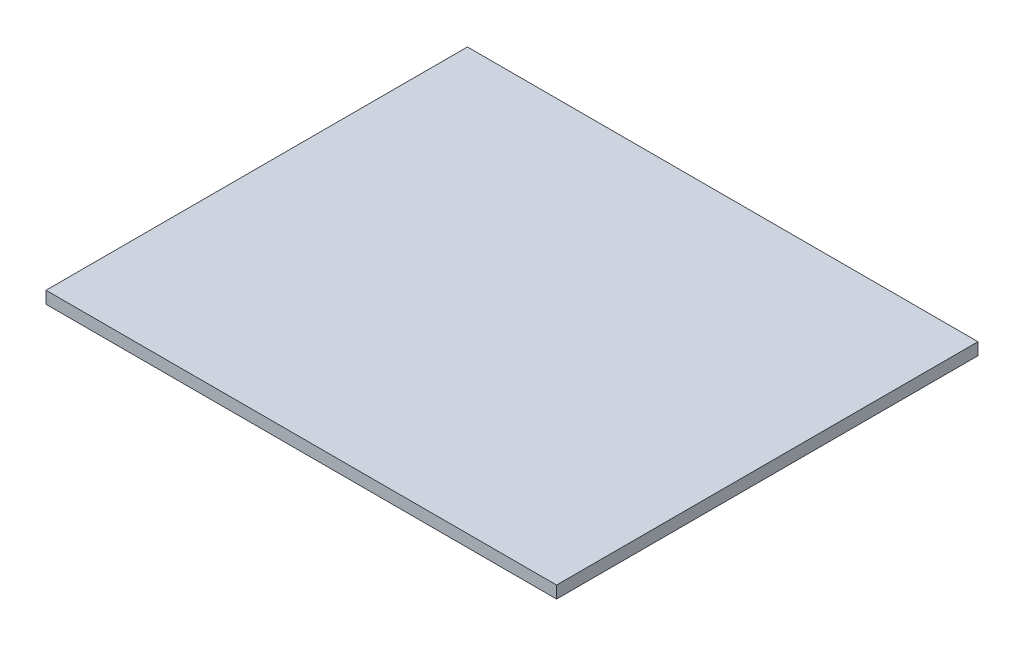
ISO-10303-21;
HEADER;
FILE_DESCRIPTION(('STEP AP214'),'2;1');
FILE_NAME('part.step','',(''),(''),'','','');
FILE_SCHEMA(('AUTOMOTIVE_DESIGN { 1 0 10303 214 1 1 1 1 }'));
ENDSEC;
DATA;
#1=APPLICATION_CONTEXT('core data for automotive mechanical design processes');
#2=APPLICATION_PROTOCOL_DEFINITION('international standard','automotive_design',2000,#1);
#3=PRODUCT_CONTEXT('',#1,'mechanical');
#4=PRODUCT('Part','Part','',(#3));
#5=PRODUCT_RELATED_PRODUCT_CATEGORY('part','',(#4));
#6=PRODUCT_DEFINITION_FORMATION('','',#4);
#7=PRODUCT_DEFINITION_CONTEXT('part definition',#1,'design');
#8=PRODUCT_DEFINITION('design','',#6,#7);
#9=PRODUCT_DEFINITION_SHAPE('','',#8);
#10=(LENGTH_UNIT() NAMED_UNIT(*) SI_UNIT(.MILLI.,.METRE.));
#11=(NAMED_UNIT(*) PLANE_ANGLE_UNIT() SI_UNIT($,.RADIAN.));
#12=(NAMED_UNIT(*) SI_UNIT($,.STERADIAN.) SOLID_ANGLE_UNIT());
#13=UNCERTAINTY_MEASURE_WITH_UNIT(LENGTH_MEASURE(1.E-05),#10,'distance_accuracy_value','');
#14=(GEOMETRIC_REPRESENTATION_CONTEXT(3) GLOBAL_UNCERTAINTY_ASSIGNED_CONTEXT((#13)) GLOBAL_UNIT_ASSIGNED_CONTEXT((#10,
#11,#12)) REPRESENTATION_CONTEXT('',''));
#15=CARTESIAN_POINT('',(0.,0.,0.));
#16=DIRECTION('',(0.,0.,1.));
#17=DIRECTION('',(1.,0.,0.));
#18=AXIS2_PLACEMENT_3D('',#15,#16,#17);
#19=CARTESIAN_POINT('',(0.,4.7625,0.));
#20=DIRECTION('',(1.,0.,0.));
#21=DIRECTION('',(0.,0.,-1.));
#22=AXIS2_PLACEMENT_3D('',#19,#20,#21);
#23=PLANE('',#22);
#24=DIRECTION('',(0.,0.,1.));
#25=VECTOR('',#24,1.);
#26=CARTESIAN_POINT('',(0.,0.,0.));
#27=LINE('',#26,#25);
#28=CARTESIAN_POINT('',(0.,0.,0.));
#29=VERTEX_POINT('',#28);
#30=CARTESIAN_POINT('',(0.,0.,165.1));
#31=VERTEX_POINT('',#30);
#32=EDGE_CURVE('E96',#29,#31,#27,.T.);
#33=ORIENTED_EDGE('',*,*,#32,.T.);
#34=DIRECTION('',(0.,-1.,0.));
#35=VECTOR('',#34,1.);
#36=CARTESIAN_POINT('',(0.,4.7625,165.1));
#37=LINE('',#36,#35);
#38=CARTESIAN_POINT('',(0.,4.7625,165.1));
#39=VERTEX_POINT('',#38);
#40=EDGE_CURVE('E11',#39,#31,#37,.T.);
#41=ORIENTED_EDGE('',*,*,#40,.F.);
#42=DIRECTION('',(0.,0.,1.));
#43=VECTOR('',#42,1.);
#44=CARTESIAN_POINT('',(0.,4.7625,0.));
#45=LINE('',#44,#43);
#46=CARTESIAN_POINT('',(0.,4.7625,0.));
#47=VERTEX_POINT('',#46);
#48=EDGE_CURVE('E82',#47,#39,#45,.T.);
#49=ORIENTED_EDGE('',*,*,#48,.F.);
#50=DIRECTION('',(0.,-1.,0.));
#51=VECTOR('',#50,1.);
#52=CARTESIAN_POINT('',(0.,4.7625,0.));
#53=LINE('',#52,#51);
#54=EDGE_CURVE('E49',#47,#29,#53,.T.);
#55=ORIENTED_EDGE('',*,*,#54,.T.);
#56=EDGE_LOOP('',(#33,#41,#49,#55));
#57=FACE_BOUND('',#56,.T.);
#58=ADVANCED_FACE('F33',(#57),#23,.F.);
#59=CARTESIAN_POINT('',(0.,4.7625,165.1));
#60=DIRECTION('',(0.,0.,-1.));
#61=DIRECTION('',(-1.,0.,0.));
#62=AXIS2_PLACEMENT_3D('',#59,#60,#61);
#63=PLANE('',#62);
#64=DIRECTION('',(1.,0.,0.));
#65=VECTOR('',#64,1.);
#66=CARTESIAN_POINT('',(0.,0.,165.1));
#67=LINE('',#66,#65);
#68=CARTESIAN_POINT('',(200.025,0.,165.1));
#69=VERTEX_POINT('',#68);
#70=EDGE_CURVE('E87',#31,#69,#67,.T.);
#71=ORIENTED_EDGE('',*,*,#70,.T.);
#72=DIRECTION('',(0.,-1.,0.));
#73=VECTOR('',#72,1.);
#74=CARTESIAN_POINT('',(200.025,4.7625,165.1));
#75=LINE('',#74,#73);
#76=CARTESIAN_POINT('',(200.025,4.7625,165.1));
#77=VERTEX_POINT('',#76);
#78=EDGE_CURVE('E41',#77,#69,#75,.T.);
#79=ORIENTED_EDGE('',*,*,#78,.F.);
#80=DIRECTION('',(1.,0.,0.));
#81=VECTOR('',#80,1.);
#82=CARTESIAN_POINT('',(0.,4.7625,165.1));
#83=LINE('',#82,#81);
#84=EDGE_CURVE('E74',#39,#77,#83,.T.);
#85=ORIENTED_EDGE('',*,*,#84,.F.);
#86=ORIENTED_EDGE('',*,*,#40,.T.);
#87=EDGE_LOOP('',(#71,#79,#85,#86));
#88=FACE_BOUND('',#87,.T.);
#89=ADVANCED_FACE('F86',(#88),#63,.F.);
#90=CARTESIAN_POINT('',(200.025,4.7625,0.));
#91=DIRECTION('',(1.,0.,0.));
#92=DIRECTION('',(0.,0.,-1.));
#93=AXIS2_PLACEMENT_3D('',#90,#91,#92);
#94=PLANE('',#93);
#95=DIRECTION('',(0.,0.,1.));
#96=VECTOR('',#95,1.);
#97=CARTESIAN_POINT('',(200.025,0.,0.));
#98=LINE('',#97,#96);
#99=CARTESIAN_POINT('',(200.025,0.,0.));
#100=VERTEX_POINT('',#99);
#101=EDGE_CURVE('E99',#100,#69,#98,.T.);
#102=ORIENTED_EDGE('',*,*,#101,.F.);
#103=DIRECTION('',(0.,-1.,0.));
#104=VECTOR('',#103,1.);
#105=CARTESIAN_POINT('',(200.025,4.7625,0.));
#106=LINE('',#105,#104);
#107=CARTESIAN_POINT('',(200.025,4.7625,0.));
#108=VERTEX_POINT('',#107);
#109=EDGE_CURVE('E63',#108,#100,#106,.T.);
#110=ORIENTED_EDGE('',*,*,#109,.F.);
#111=DIRECTION('',(0.,0.,1.));
#112=VECTOR('',#111,1.);
#113=CARTESIAN_POINT('',(200.025,4.7625,0.));
#114=LINE('',#113,#112);
#115=EDGE_CURVE('E81',#108,#77,#114,.T.);
#116=ORIENTED_EDGE('',*,*,#115,.T.);
#117=ORIENTED_EDGE('',*,*,#78,.T.);
#118=EDGE_LOOP('',(#102,#110,#116,#117));
#119=FACE_BOUND('',#118,.T.);
#120=ADVANCED_FACE('F90',(#119),#94,.T.);
#121=CARTESIAN_POINT('',(0.,4.7625,0.));
#122=DIRECTION('',(0.,0.,-1.));
#123=DIRECTION('',(-1.,0.,0.));
#124=AXIS2_PLACEMENT_3D('',#121,#122,#123);
#125=PLANE('',#124);
#126=DIRECTION('',(1.,0.,0.));
#127=VECTOR('',#126,1.);
#128=CARTESIAN_POINT('',(0.,0.,0.));
#129=LINE('',#128,#127);
#130=EDGE_CURVE('E101',#29,#100,#129,.T.);
#131=ORIENTED_EDGE('',*,*,#130,.F.);
#132=ORIENTED_EDGE('',*,*,#54,.F.);
#133=DIRECTION('',(1.,0.,0.));
#134=VECTOR('',#133,1.);
#135=CARTESIAN_POINT('',(0.,4.7625,0.));
#136=LINE('',#135,#134);
#137=EDGE_CURVE('E91',#47,#108,#136,.T.);
#138=ORIENTED_EDGE('',*,*,#137,.T.);
#139=ORIENTED_EDGE('',*,*,#109,.T.);
#140=EDGE_LOOP('',(#131,#132,#138,#139));
#141=FACE_BOUND('',#140,.T.);
#142=ADVANCED_FACE('F107',(#141),#125,.T.);
#143=CARTESIAN_POINT('',(0.,4.7625,0.));
#144=DIRECTION('',(0.,1.,0.));
#145=DIRECTION('',(0.,0.,1.));
#146=AXIS2_PLACEMENT_3D('',#143,#144,#145);
#147=PLANE('',#146);
#148=ORIENTED_EDGE('',*,*,#48,.T.);
#149=ORIENTED_EDGE('',*,*,#84,.T.);
#150=ORIENTED_EDGE('',*,*,#115,.F.);
#151=ORIENTED_EDGE('',*,*,#137,.F.);
#152=EDGE_LOOP('',(#148,#149,#150,#151));
#153=FACE_BOUND('',#152,.T.);
#154=ADVANCED_FACE('F78',(#153),#147,.T.);
#155=CARTESIAN_POINT('',(0.,0.,0.));
#156=DIRECTION('',(0.,1.,0.));
#157=DIRECTION('',(0.,0.,1.));
#158=AXIS2_PLACEMENT_3D('',#155,#156,#157);
#159=PLANE('',#158);
#160=ORIENTED_EDGE('',*,*,#32,.F.);
#161=ORIENTED_EDGE('',*,*,#130,.T.);
#162=ORIENTED_EDGE('',*,*,#101,.T.);
#163=ORIENTED_EDGE('',*,*,#70,.F.);
#164=EDGE_LOOP('',(#160,#161,#162,#163));
#165=FACE_BOUND('',#164,.T.);
#166=ADVANCED_FACE('F106',(#165),#159,.F.);
#167=CLOSED_SHELL('',(#58,#89,#120,#142,#154,#166));
#168=MANIFOLD_SOLID_BREP('B2',#167);
#169=ADVANCED_BREP_SHAPE_REPRESENTATION('',(#18,#168),#14);
#170=SHAPE_DEFINITION_REPRESENTATION(#9,#169);
ENDSEC;
END-ISO-10303-21;
